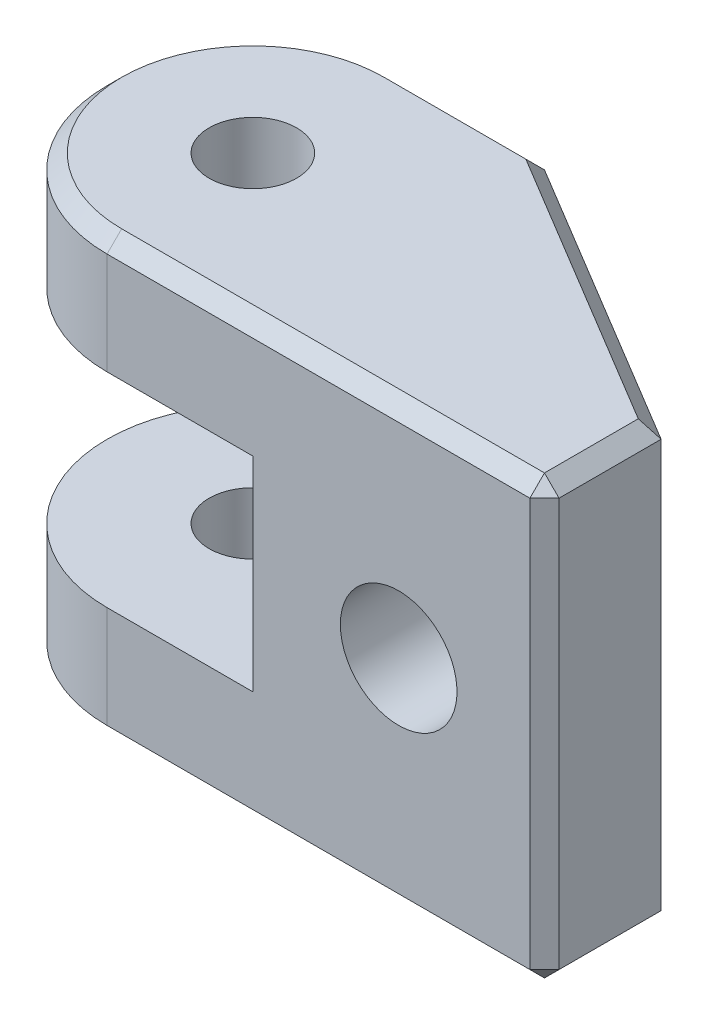
ISO-10303-21;
HEADER;
FILE_DESCRIPTION(('STEP AP214'),'2;1');
FILE_NAME('part.step','',(''),(''),'','','');
FILE_SCHEMA(('AUTOMOTIVE_DESIGN { 1 0 10303 214 1 1 1 1 }'));
ENDSEC;
DATA;
#1=APPLICATION_CONTEXT('core data for automotive mechanical design processes');
#2=APPLICATION_PROTOCOL_DEFINITION('international standard','automotive_design',2000,#1);
#3=PRODUCT_CONTEXT('',#1,'mechanical');
#4=PRODUCT('Part','Part','',(#3));
#5=PRODUCT_RELATED_PRODUCT_CATEGORY('part','',(#4));
#6=PRODUCT_DEFINITION_FORMATION('','',#4);
#7=PRODUCT_DEFINITION_CONTEXT('part definition',#1,'design');
#8=PRODUCT_DEFINITION('design','',#6,#7);
#9=PRODUCT_DEFINITION_SHAPE('','',#8);
#10=(LENGTH_UNIT() NAMED_UNIT(*) SI_UNIT(.MILLI.,.METRE.));
#11=(NAMED_UNIT(*) PLANE_ANGLE_UNIT() SI_UNIT($,.RADIAN.));
#12=(NAMED_UNIT(*) SI_UNIT($,.STERADIAN.) SOLID_ANGLE_UNIT());
#13=UNCERTAINTY_MEASURE_WITH_UNIT(LENGTH_MEASURE(1.E-05),#10,'distance_accuracy_value','');
#14=(GEOMETRIC_REPRESENTATION_CONTEXT(3) GLOBAL_UNCERTAINTY_ASSIGNED_CONTEXT((#13)) GLOBAL_UNIT_ASSIGNED_CONTEXT((#10,
#11,#12)) REPRESENTATION_CONTEXT('',''));
#15=CARTESIAN_POINT('',(0.,0.,0.));
#16=DIRECTION('',(0.,0.,1.));
#17=DIRECTION('',(1.,0.,0.));
#18=AXIS2_PLACEMENT_3D('',#15,#16,#17);
#19=CARTESIAN_POINT('',(10.,15.,-10.));
#20=DIRECTION('',(-0.514495755427526,0.,0.857492925712544));
#21=DIRECTION('',(0.857492925712544,0.,0.514495755427526));
#22=AXIS2_PLACEMENT_3D('',#19,#20,#21);
#23=PLANE('',#22);
#24=DIRECTION('',(0.,-1.,0.));
#25=VECTOR('',#24,1.);
#26=CARTESIAN_POINT('',(20.,15.,-4.));
#27=LINE('',#26,#25);
#28=CARTESIAN_POINT('',(20.,4.,-4.));
#29=VERTEX_POINT('',#28);
#30=CARTESIAN_POINT('',(20.,0.500000000000002,-4.));
#31=VERTEX_POINT('',#30);
#32=EDGE_CURVE('E182',#29,#31,#27,.T.);
#33=ORIENTED_EDGE('',*,*,#32,.T.);
#34=DIRECTION('',(-0.857492925712544,0.,-0.514495755427526));
#35=VECTOR('',#34,1.);
#36=CARTESIAN_POINT('',(10.,0.500000000000002,-10.));
#37=LINE('',#36,#35);
#38=CARTESIAN_POINT('',(10.,0.500000000000002,-10.));
#39=VERTEX_POINT('',#38);
#40=EDGE_CURVE('E281',#31,#39,#37,.T.);
#41=ORIENTED_EDGE('',*,*,#40,.T.);
#42=DIRECTION('',(0.,-1.,0.));
#43=VECTOR('',#42,1.);
#44=CARTESIAN_POINT('',(10.,15.,-10.));
#45=LINE('',#44,#43);
#46=CARTESIAN_POINT('',(10.,4.,-10.));
#47=VERTEX_POINT('',#46);
#48=EDGE_CURVE('E231',#47,#39,#45,.T.);
#49=ORIENTED_EDGE('',*,*,#48,.F.);
#50=DIRECTION('',(0.857492925712544,0.,0.514495755427526));
#51=VECTOR('',#50,1.);
#52=CARTESIAN_POINT('',(10.,4.,-10.));
#53=LINE('',#52,#51);
#54=EDGE_CURVE('E193',#47,#29,#53,.T.);
#55=ORIENTED_EDGE('',*,*,#54,.T.);
#56=EDGE_LOOP('',(#33,#41,#49,#55));
#57=FACE_BOUND('',#56,.T.);
#58=ADVANCED_FACE('F33',(#57),#23,.F.);
#59=CARTESIAN_POINT('',(10.,0.,0.));
#60=DIRECTION('',(1.,0.,0.));
#61=DIRECTION('',(0.,0.,-1.));
#62=AXIS2_PLACEMENT_3D('',#59,#60,#61);
#63=PLANE('',#62);
#64=DIRECTION('',(0.,-1.,0.));
#65=VECTOR('',#64,1.);
#66=CARTESIAN_POINT('',(10.,0.,-4.));
#67=LINE('',#66,#65);
#68=CARTESIAN_POINT('',(10.,11.,-4.));
#69=VERTEX_POINT('',#68);
#70=CARTESIAN_POINT('',(10.,4.,-4.));
#71=VERTEX_POINT('',#70);
#72=EDGE_CURVE('E201',#69,#71,#67,.T.);
#73=ORIENTED_EDGE('',*,*,#72,.T.);
#74=DIRECTION('',(0.,0.,-1.));
#75=VECTOR('',#74,1.);
#76=CARTESIAN_POINT('',(10.,4.,0.));
#77=LINE('',#76,#75);
#78=CARTESIAN_POINT('',(10.,4.,0.));
#79=VERTEX_POINT('',#78);
#80=EDGE_CURVE('E228',#79,#71,#77,.T.);
#81=ORIENTED_EDGE('',*,*,#80,.F.);
#82=DIRECTION('',(0.,-1.,0.));
#83=VECTOR('',#82,1.);
#84=CARTESIAN_POINT('',(10.,0.,0.));
#85=LINE('',#84,#83);
#86=CARTESIAN_POINT('',(10.,11.,0.));
#87=VERTEX_POINT('',#86);
#88=EDGE_CURVE('E222',#87,#79,#85,.T.);
#89=ORIENTED_EDGE('',*,*,#88,.F.);
#90=DIRECTION('',(0.,0.,-1.));
#91=VECTOR('',#90,1.);
#92=CARTESIAN_POINT('',(10.,11.,0.));
#93=LINE('',#92,#91);
#94=EDGE_CURVE('E225',#87,#69,#93,.T.);
#95=ORIENTED_EDGE('',*,*,#94,.T.);
#96=EDGE_LOOP('',(#73,#81,#89,#95));
#97=FACE_BOUND('',#96,.T.);
#98=ADVANCED_FACE('F391',(#97),#63,.F.);
#99=CARTESIAN_POINT('',(0.,15.,0.));
#100=DIRECTION('',(0.,0.,-1.));
#101=DIRECTION('',(-1.,0.,0.));
#102=AXIS2_PLACEMENT_3D('',#99,#100,#101);
#103=PLANE('',#102);
#104=CARTESIAN_POINT('',(15.,7.5,0.));
#105=DIRECTION('',(0.,0.,-1.));
#106=DIRECTION('',(-1.,0.,0.));
#107=AXIS2_PLACEMENT_3D('',#104,#105,#106);
#108=CIRCLE('',#107,2.);
#109=CARTESIAN_POINT('',(13.,7.5,0.));
#110=VERTEX_POINT('',#109);
#111=EDGE_CURVE('E208',#110,#110,#108,.T.);
#112=ORIENTED_EDGE('',*,*,#111,.T.);
#113=EDGE_LOOP('',(#112));
#114=FACE_BOUND('',#113,.T.);
#115=DIRECTION('',(0.,-1.,0.));
#116=VECTOR('',#115,1.);
#117=CARTESIAN_POINT('',(5.,15.,0.));
#118=LINE('',#117,#116);
#119=CARTESIAN_POINT('',(5.,4.,0.));
#120=VERTEX_POINT('',#119);
#121=CARTESIAN_POINT('',(5.,0.500000000000002,0.));
#122=VERTEX_POINT('',#121);
#123=EDGE_CURVE('E236',#120,#122,#118,.T.);
#124=ORIENTED_EDGE('',*,*,#123,.T.);
#125=DIRECTION('',(1.,0.,0.));
#126=VECTOR('',#125,1.);
#127=CARTESIAN_POINT('',(20.,0.500000000000002,0.));
#128=LINE('',#127,#126);
#129=CARTESIAN_POINT('',(19.5,0.500000000000002,0.));
#130=VERTEX_POINT('',#129);
#131=EDGE_CURVE('E293',#122,#130,#128,.T.);
#132=ORIENTED_EDGE('',*,*,#131,.T.);
#133=DIRECTION('',(0.,1.,0.));
#134=VECTOR('',#133,1.);
#135=CARTESIAN_POINT('',(19.5,15.,0.));
#136=LINE('',#135,#134);
#137=CARTESIAN_POINT('',(19.5,14.5,0.));
#138=VERTEX_POINT('',#137);
#139=EDGE_CURVE('E291',#130,#138,#136,.T.);
#140=ORIENTED_EDGE('',*,*,#139,.T.);
#141=DIRECTION('',(-1.,0.,0.));
#142=VECTOR('',#141,1.);
#143=CARTESIAN_POINT('',(0.,14.5,0.));
#144=LINE('',#143,#142);
#145=CARTESIAN_POINT('',(5.,14.5,0.));
#146=VERTEX_POINT('',#145);
#147=EDGE_CURVE('E289',#138,#146,#144,.T.);
#148=ORIENTED_EDGE('',*,*,#147,.T.);
#149=DIRECTION('',(0.,-1.,0.));
#150=VECTOR('',#149,1.);
#151=CARTESIAN_POINT('',(5.,15.,0.));
#152=LINE('',#151,#150);
#153=CARTESIAN_POINT('',(5.,11.,0.));
#154=VERTEX_POINT('',#153);
#155=EDGE_CURVE('E181',#146,#154,#152,.T.);
#156=ORIENTED_EDGE('',*,*,#155,.T.);
#157=DIRECTION('',(-1.,0.,0.));
#158=VECTOR('',#157,1.);
#159=CARTESIAN_POINT('',(0.,11.,0.));
#160=LINE('',#159,#158);
#161=EDGE_CURVE('E220',#87,#154,#160,.T.);
#162=ORIENTED_EDGE('',*,*,#161,.F.);
#163=ORIENTED_EDGE('',*,*,#88,.T.);
#164=DIRECTION('',(1.,0.,0.));
#165=VECTOR('',#164,1.);
#166=CARTESIAN_POINT('',(0.,4.,0.));
#167=LINE('',#166,#165);
#168=EDGE_CURVE('E218',#120,#79,#167,.T.);
#169=ORIENTED_EDGE('',*,*,#168,.F.);
#170=EDGE_LOOP('',(#124,#132,#140,#148,#156,#162,#163,#169));
#171=FACE_BOUND('',#170,.T.);
#172=ADVANCED_FACE('F397',(#114,#171),#103,.F.);
#173=CARTESIAN_POINT('',(0.,15.,-10.));
#174=DIRECTION('',(0.,0.,1.));
#175=DIRECTION('',(1.,0.,0.));
#176=AXIS2_PLACEMENT_3D('',#173,#174,#175);
#177=PLANE('',#176);
#178=ORIENTED_EDGE('',*,*,#48,.T.);
#179=DIRECTION('',(-1.,0.,0.));
#180=VECTOR('',#179,1.);
#181=CARTESIAN_POINT('',(5.,0.500000000000002,-10.));
#182=LINE('',#181,#180);
#183=CARTESIAN_POINT('',(5.,0.500000000000004,-10.));
#184=VERTEX_POINT('',#183);
#185=EDGE_CURVE('E283',#39,#184,#182,.T.);
#186=ORIENTED_EDGE('',*,*,#185,.T.);
#187=DIRECTION('',(0.,-1.,0.));
#188=VECTOR('',#187,1.);
#189=CARTESIAN_POINT('',(5.,15.,-10.));
#190=LINE('',#189,#188);
#191=CARTESIAN_POINT('',(5.,4.,-10.));
#192=VERTEX_POINT('',#191);
#193=EDGE_CURVE('E243',#184,#192,#190,.F.);
#194=ORIENTED_EDGE('',*,*,#193,.T.);
#195=DIRECTION('',(1.,0.,0.));
#196=VECTOR('',#195,1.);
#197=CARTESIAN_POINT('',(0.,4.,-10.));
#198=LINE('',#197,#196);
#199=EDGE_CURVE('E217',#192,#47,#198,.T.);
#200=ORIENTED_EDGE('',*,*,#199,.T.);
#201=EDGE_LOOP('',(#178,#186,#194,#200));
#202=FACE_BOUND('',#201,.T.);
#203=ADVANCED_FACE('F414',(#202),#177,.F.);
#204=DIRECTION('',(0.,-1.,0.));
#205=VECTOR('',#204,1.);
#206=CARTESIAN_POINT('',(5.,15.,-10.));
#207=LINE('',#206,#205);
#208=CARTESIAN_POINT('',(5.,11.,-10.));
#209=VERTEX_POINT('',#208);
#210=CARTESIAN_POINT('',(5.,14.5,-10.));
#211=VERTEX_POINT('',#210);
#212=EDGE_CURVE('E250',#209,#211,#207,.F.);
#213=ORIENTED_EDGE('',*,*,#212,.T.);
#214=DIRECTION('',(1.,0.,0.));
#215=VECTOR('',#214,1.);
#216=CARTESIAN_POINT('',(0.,14.5,-10.));
#217=LINE('',#216,#215);
#218=CARTESIAN_POINT('',(10.,14.5,-10.));
#219=VERTEX_POINT('',#218);
#220=EDGE_CURVE('E42',#211,#219,#217,.T.);
#221=ORIENTED_EDGE('',*,*,#220,.T.);
#222=CARTESIAN_POINT('',(10.,11.,-10.));
#223=VERTEX_POINT('',#222);
#224=EDGE_CURVE('E233',#219,#223,#45,.T.);
#225=ORIENTED_EDGE('',*,*,#224,.T.);
#226=DIRECTION('',(-1.,0.,0.));
#227=VECTOR('',#226,1.);
#228=CARTESIAN_POINT('',(0.,11.,-10.));
#229=LINE('',#228,#227);
#230=EDGE_CURVE('E192',#223,#209,#229,.T.);
#231=ORIENTED_EDGE('',*,*,#230,.T.);
#232=EDGE_LOOP('',(#213,#221,#225,#231));
#233=FACE_BOUND('',#232,.T.);
#234=ADVANCED_FACE('F410',(#233),#177,.F.);
#235=CARTESIAN_POINT('',(20.,15.,0.));
#236=DIRECTION('',(-1.,0.,0.));
#237=DIRECTION('',(0.,0.,1.));
#238=AXIS2_PLACEMENT_3D('',#235,#236,#237);
#239=PLANE('',#238);
#240=DIRECTION('',(0.,-1.,0.));
#241=VECTOR('',#240,1.);
#242=CARTESIAN_POINT('',(20.,15.,-0.500000000000002));
#243=LINE('',#242,#241);
#244=CARTESIAN_POINT('',(20.,14.5,-0.500000000000002));
#245=VERTEX_POINT('',#244);
#246=CARTESIAN_POINT('',(20.,0.500000000000002,-0.500000000000002));
#247=VERTEX_POINT('',#246);
#248=EDGE_CURVE('E264',#245,#247,#243,.T.);
#249=ORIENTED_EDGE('',*,*,#248,.T.);
#250=DIRECTION('',(0.,0.,-1.));
#251=VECTOR('',#250,1.);
#252=CARTESIAN_POINT('',(20.,0.500000000000002,-4.));
#253=LINE('',#252,#251);
#254=EDGE_CURVE('E266',#247,#31,#253,.T.);
#255=ORIENTED_EDGE('',*,*,#254,.T.);
#256=ORIENTED_EDGE('',*,*,#32,.F.);
#257=DIRECTION('',(0.,-1.,0.));
#258=VECTOR('',#257,1.);
#259=CARTESIAN_POINT('',(20.,0.,-4.));
#260=LINE('',#259,#258);
#261=CARTESIAN_POINT('',(20.,11.,-4.));
#262=VERTEX_POINT('',#261);
#263=EDGE_CURVE('E198',#262,#29,#260,.T.);
#264=ORIENTED_EDGE('',*,*,#263,.F.);
#265=CARTESIAN_POINT('',(20.,14.5,-4.));
#266=VERTEX_POINT('',#265);
#267=EDGE_CURVE('E172',#266,#262,#27,.T.);
#268=ORIENTED_EDGE('',*,*,#267,.F.);
#269=DIRECTION('',(0.,0.,1.));
#270=VECTOR('',#269,1.);
#271=CARTESIAN_POINT('',(20.,14.5,0.));
#272=LINE('',#271,#270);
#273=EDGE_CURVE('E252',#266,#245,#272,.T.);
#274=ORIENTED_EDGE('',*,*,#273,.T.);
#275=EDGE_LOOP('',(#249,#255,#256,#264,#268,#274));
#276=FACE_BOUND('',#275,.T.);
#277=ADVANCED_FACE('F204',(#276),#239,.F.);
#278=ORIENTED_EDGE('',*,*,#224,.F.);
#279=DIRECTION('',(0.857492925712544,0.,0.514495755427526));
#280=VECTOR('',#279,1.);
#281=CARTESIAN_POINT('',(10.,14.5,-10.));
#282=LINE('',#281,#280);
#283=EDGE_CURVE('E11',#219,#266,#282,.T.);
#284=ORIENTED_EDGE('',*,*,#283,.T.);
#285=ORIENTED_EDGE('',*,*,#267,.T.);
#286=DIRECTION('',(-0.857492925712544,0.,-0.514495755427526));
#287=VECTOR('',#286,1.);
#288=CARTESIAN_POINT('',(10.,11.,-10.));
#289=LINE('',#288,#287);
#290=EDGE_CURVE('E175',#262,#223,#289,.T.);
#291=ORIENTED_EDGE('',*,*,#290,.T.);
#292=EDGE_LOOP('',(#278,#284,#285,#291));
#293=FACE_BOUND('',#292,.T.);
#294=ADVANCED_FACE('F174',(#293),#23,.F.);
#295=CARTESIAN_POINT('',(0.,15.,0.));
#296=DIRECTION('',(0.,-1.,0.));
#297=DIRECTION('',(0.,0.,-1.));
#298=AXIS2_PLACEMENT_3D('',#295,#296,#297);
#299=PLANE('',#298);
#300=DIRECTION('',(1.,0.,0.));
#301=VECTOR('',#300,1.);
#302=CARTESIAN_POINT('',(0.,15.,-0.500000000000002));
#303=LINE('',#302,#301);
#304=CARTESIAN_POINT('',(5.,15.,-0.500000000000002));
#305=VERTEX_POINT('',#304);
#306=CARTESIAN_POINT('',(19.5,15.,-0.500000000000002));
#307=VERTEX_POINT('',#306);
#308=EDGE_CURVE('E303',#305,#307,#303,.T.);
#309=ORIENTED_EDGE('',*,*,#308,.T.);
#310=DIRECTION('',(0.,0.,-1.));
#311=VECTOR('',#310,1.);
#312=CARTESIAN_POINT('',(19.5,15.,0.));
#313=LINE('',#312,#311);
#314=CARTESIAN_POINT('',(19.5,15.,-3.71690481051547));
#315=VERTEX_POINT('',#314);
#316=EDGE_CURVE('E305',#307,#315,#313,.T.);
#317=ORIENTED_EDGE('',*,*,#316,.T.);
#318=DIRECTION('',(-0.857492925712544,0.,-0.514495755427526));
#319=VECTOR('',#318,1.);
#320=CARTESIAN_POINT('',(6.801575651698,15.,-11.3359594194967));
#321=LINE('',#320,#319);
#322=CARTESIAN_POINT('',(9.86150801752578,15.,-9.5));
#323=VERTEX_POINT('',#322);
#324=EDGE_CURVE('E295',#315,#323,#321,.T.);
#325=ORIENTED_EDGE('',*,*,#324,.T.);
#326=DIRECTION('',(-1.,0.,0.));
#327=VECTOR('',#326,1.);
#328=CARTESIAN_POINT('',(0.,15.,-9.5));
#329=LINE('',#328,#327);
#330=CARTESIAN_POINT('',(5.,15.,-9.5));
#331=VERTEX_POINT('',#330);
#332=EDGE_CURVE('E297',#323,#331,#329,.T.);
#333=ORIENTED_EDGE('',*,*,#332,.T.);
#334=CARTESIAN_POINT('',(5.,15.,-5.));
#335=DIRECTION('',(0.,-1.,0.));
#336=DIRECTION('',(0.,0.,-1.));
#337=AXIS2_PLACEMENT_3D('',#334,#335,#336);
#338=CIRCLE('',#337,4.5);
#339=CARTESIAN_POINT('',(0.500000000000002,15.,-5.));
#340=VERTEX_POINT('',#339);
#341=EDGE_CURVE('E299',#331,#340,#338,.F.);
#342=ORIENTED_EDGE('',*,*,#341,.T.);
#343=CARTESIAN_POINT('',(5.,15.,-5.));
#344=DIRECTION('',(0.,-1.,0.));
#345=DIRECTION('',(0.,0.,-1.));
#346=AXIS2_PLACEMENT_3D('',#343,#344,#345);
#347=CIRCLE('',#346,4.5);
#348=EDGE_CURVE('E301',#340,#305,#347,.F.);
#349=ORIENTED_EDGE('',*,*,#348,.T.);
#350=EDGE_LOOP('',(#309,#317,#325,#333,#342,#349));
#351=FACE_BOUND('',#350,.T.);
#352=CARTESIAN_POINT('',(5.,15.,-5.));
#353=DIRECTION('',(0.,-1.,0.));
#354=DIRECTION('',(0.,0.,-1.));
#355=AXIS2_PLACEMENT_3D('',#352,#353,#354);
#356=CIRCLE('',#355,1.5);
#357=CARTESIAN_POINT('',(5.,15.,-6.5));
#358=VERTEX_POINT('',#357);
#359=EDGE_CURVE('E262',#358,#358,#356,.T.);
#360=ORIENTED_EDGE('',*,*,#359,.T.);
#361=EDGE_LOOP('',(#360));
#362=FACE_BOUND('',#361,.T.);
#363=ADVANCED_FACE('F402',(#351,#362),#299,.F.);
#364=CARTESIAN_POINT('',(0.,0.,0.));
#365=DIRECTION('',(0.,-1.,0.));
#366=DIRECTION('',(0.,0.,-1.));
#367=AXIS2_PLACEMENT_3D('',#364,#365,#366);
#368=PLANE('',#367);
#369=DIRECTION('',(0.857492925712544,0.,0.514495755427526));
#370=VECTOR('',#369,1.);
#371=CARTESIAN_POINT('',(19.7427521222862,0.,-3.57125353714372));
#372=LINE('',#371,#370);
#373=CARTESIAN_POINT('',(9.86150801752578,0.,-9.5));
#374=VERTEX_POINT('',#373);
#375=CARTESIAN_POINT('',(19.5,0.,-3.71690481051547));
#376=VERTEX_POINT('',#375);
#377=EDGE_CURVE('E276',#374,#376,#372,.T.);
#378=ORIENTED_EDGE('',*,*,#377,.T.);
#379=DIRECTION('',(0.,0.,1.));
#380=VECTOR('',#379,1.);
#381=CARTESIAN_POINT('',(19.5,0.,0.));
#382=LINE('',#381,#380);
#383=CARTESIAN_POINT('',(19.5,0.,-0.500000000000004));
#384=VERTEX_POINT('',#383);
#385=EDGE_CURVE('E278',#376,#384,#382,.T.);
#386=ORIENTED_EDGE('',*,*,#385,.T.);
#387=DIRECTION('',(-1.,0.,0.));
#388=VECTOR('',#387,1.);
#389=CARTESIAN_POINT('',(5.,0.,-0.500000000000004));
#390=LINE('',#389,#388);
#391=CARTESIAN_POINT('',(5.,0.,-0.500000000000004));
#392=VERTEX_POINT('',#391);
#393=EDGE_CURVE('E268',#384,#392,#390,.T.);
#394=ORIENTED_EDGE('',*,*,#393,.T.);
#395=CARTESIAN_POINT('',(5.,0.,-5.));
#396=DIRECTION('',(0.,-1.,0.));
#397=DIRECTION('',(0.,0.,-1.));
#398=AXIS2_PLACEMENT_3D('',#395,#396,#397);
#399=CIRCLE('',#398,4.5);
#400=CARTESIAN_POINT('',(0.500000000000002,0.,-5.));
#401=VERTEX_POINT('',#400);
#402=EDGE_CURVE('E270',#392,#401,#399,.T.);
#403=ORIENTED_EDGE('',*,*,#402,.T.);
#404=CARTESIAN_POINT('',(5.,0.,-5.));
#405=DIRECTION('',(0.,-1.,0.));
#406=DIRECTION('',(0.,0.,-1.));
#407=AXIS2_PLACEMENT_3D('',#404,#405,#406);
#408=CIRCLE('',#407,4.5);
#409=CARTESIAN_POINT('',(5.,0.,-9.5));
#410=VERTEX_POINT('',#409);
#411=EDGE_CURVE('E272',#401,#410,#408,.T.);
#412=ORIENTED_EDGE('',*,*,#411,.T.);
#413=DIRECTION('',(1.,0.,0.));
#414=VECTOR('',#413,1.);
#415=CARTESIAN_POINT('',(10.,0.,-9.5));
#416=LINE('',#415,#414);
#417=EDGE_CURVE('E274',#410,#374,#416,.T.);
#418=ORIENTED_EDGE('',*,*,#417,.T.);
#419=EDGE_LOOP('',(#378,#386,#394,#403,#412,#418));
#420=FACE_BOUND('',#419,.T.);
#421=CARTESIAN_POINT('',(5.,0.,-5.));
#422=DIRECTION('',(0.,-1.,0.));
#423=DIRECTION('',(0.,0.,-1.));
#424=AXIS2_PLACEMENT_3D('',#421,#422,#423);
#425=CIRCLE('',#424,1.5);
#426=CARTESIAN_POINT('',(5.,0.,-6.5));
#427=VERTEX_POINT('',#426);
#428=EDGE_CURVE('E357',#427,#427,#425,.T.);
#429=ORIENTED_EDGE('',*,*,#428,.F.);
#430=EDGE_LOOP('',(#429));
#431=FACE_BOUND('',#430,.T.);
#432=ADVANCED_FACE('F407',(#420,#431),#368,.T.);
#433=CARTESIAN_POINT('',(0.,4.,0.));
#434=DIRECTION('',(0.,1.,0.));
#435=DIRECTION('',(0.,0.,1.));
#436=AXIS2_PLACEMENT_3D('',#433,#434,#435);
#437=PLANE('',#436);
#438=CARTESIAN_POINT('',(5.,4.,-5.));
#439=DIRECTION('',(0.,1.,0.));
#440=DIRECTION('',(0.,0.,1.));
#441=AXIS2_PLACEMENT_3D('',#438,#439,#440);
#442=CIRCLE('',#441,1.5);
#443=CARTESIAN_POINT('',(5.,4.,-3.5));
#444=VERTEX_POINT('',#443);
#445=EDGE_CURVE('E258',#444,#444,#442,.T.);
#446=ORIENTED_EDGE('',*,*,#445,.F.);
#447=EDGE_LOOP('',(#446));
#448=FACE_BOUND('',#447,.T.);
#449=CARTESIAN_POINT('',(5.,4.,-5.));
#450=DIRECTION('',(0.,1.,0.));
#451=DIRECTION('',(0.,0.,1.));
#452=AXIS2_PLACEMENT_3D('',#449,#450,#451);
#453=CIRCLE('',#452,5.);
#454=CARTESIAN_POINT('',(0.,4.,-5.));
#455=VERTEX_POINT('',#454);
#456=EDGE_CURVE('E239',#192,#455,#453,.T.);
#457=ORIENTED_EDGE('',*,*,#456,.T.);
#458=CARTESIAN_POINT('',(5.,4.,-5.));
#459=DIRECTION('',(0.,1.,0.));
#460=DIRECTION('',(0.,0.,1.));
#461=AXIS2_PLACEMENT_3D('',#458,#459,#460);
#462=CIRCLE('',#461,5.);
#463=EDGE_CURVE('E241',#455,#120,#462,.T.);
#464=ORIENTED_EDGE('',*,*,#463,.T.);
#465=ORIENTED_EDGE('',*,*,#168,.T.);
#466=ORIENTED_EDGE('',*,*,#80,.T.);
#467=DIRECTION('',(-1.,0.,0.));
#468=VECTOR('',#467,1.);
#469=CARTESIAN_POINT('',(20.,4.,-4.));
#470=LINE('',#469,#468);
#471=EDGE_CURVE('E194',#29,#71,#470,.T.);
#472=ORIENTED_EDGE('',*,*,#471,.F.);
#473=ORIENTED_EDGE('',*,*,#54,.F.);
#474=ORIENTED_EDGE('',*,*,#199,.F.);
#475=EDGE_LOOP('',(#457,#464,#465,#466,#472,#473,#474));
#476=FACE_BOUND('',#475,.T.);
#477=ADVANCED_FACE('F386',(#448,#476),#437,.T.);
#478=CARTESIAN_POINT('',(0.,11.,0.));
#479=DIRECTION('',(0.,-1.,0.));
#480=DIRECTION('',(0.,0.,-1.));
#481=AXIS2_PLACEMENT_3D('',#478,#479,#480);
#482=PLANE('',#481);
#483=CARTESIAN_POINT('',(5.,11.,-5.));
#484=DIRECTION('',(0.,-1.,0.));
#485=DIRECTION('',(0.,0.,-1.));
#486=AXIS2_PLACEMENT_3D('',#483,#484,#485);
#487=CIRCLE('',#486,1.5);
#488=CARTESIAN_POINT('',(5.,11.,-6.5));
#489=VERTEX_POINT('',#488);
#490=EDGE_CURVE('E259',#489,#489,#487,.T.);
#491=ORIENTED_EDGE('',*,*,#490,.F.);
#492=EDGE_LOOP('',(#491));
#493=FACE_BOUND('',#492,.T.);
#494=ORIENTED_EDGE('',*,*,#161,.T.);
#495=CARTESIAN_POINT('',(5.,11.,-5.));
#496=DIRECTION('',(0.,-1.,0.));
#497=DIRECTION('',(0.,0.,-1.));
#498=AXIS2_PLACEMENT_3D('',#495,#496,#497);
#499=CIRCLE('',#498,5.);
#500=CARTESIAN_POINT('',(0.,11.,-5.));
#501=VERTEX_POINT('',#500);
#502=EDGE_CURVE('E247',#154,#501,#499,.T.);
#503=ORIENTED_EDGE('',*,*,#502,.T.);
#504=CARTESIAN_POINT('',(5.,11.,-5.));
#505=DIRECTION('',(0.,-1.,0.));
#506=DIRECTION('',(0.,0.,-1.));
#507=AXIS2_PLACEMENT_3D('',#504,#505,#506);
#508=CIRCLE('',#507,5.);
#509=EDGE_CURVE('E245',#501,#209,#508,.T.);
#510=ORIENTED_EDGE('',*,*,#509,.T.);
#511=ORIENTED_EDGE('',*,*,#230,.F.);
#512=ORIENTED_EDGE('',*,*,#290,.F.);
#513=DIRECTION('',(-1.,0.,0.));
#514=VECTOR('',#513,1.);
#515=CARTESIAN_POINT('',(20.,11.,-4.));
#516=LINE('',#515,#514);
#517=EDGE_CURVE('E189',#262,#69,#516,.T.);
#518=ORIENTED_EDGE('',*,*,#517,.T.);
#519=ORIENTED_EDGE('',*,*,#94,.F.);
#520=EDGE_LOOP('',(#494,#503,#510,#511,#512,#518,#519));
#521=FACE_BOUND('',#520,.T.);
#522=ADVANCED_FACE('F188',(#493,#521),#482,.T.);
#523=CARTESIAN_POINT('',(20.,0.,-4.));
#524=DIRECTION('',(0.,0.,-1.));
#525=DIRECTION('',(-1.,0.,0.));
#526=AXIS2_PLACEMENT_3D('',#523,#524,#525);
#527=PLANE('',#526);
#528=CARTESIAN_POINT('',(15.,7.5,-4.));
#529=DIRECTION('',(0.,0.,-1.));
#530=DIRECTION('',(-1.,0.,0.));
#531=AXIS2_PLACEMENT_3D('',#528,#529,#530);
#532=CIRCLE('',#531,2.);
#533=CARTESIAN_POINT('',(13.,7.5,-4.));
#534=VERTEX_POINT('',#533);
#535=EDGE_CURVE('E211',#534,#534,#532,.T.);
#536=ORIENTED_EDGE('',*,*,#535,.F.);
#537=EDGE_LOOP('',(#536));
#538=FACE_BOUND('',#537,.T.);
#539=ORIENTED_EDGE('',*,*,#72,.F.);
#540=ORIENTED_EDGE('',*,*,#517,.F.);
#541=ORIENTED_EDGE('',*,*,#263,.T.);
#542=ORIENTED_EDGE('',*,*,#471,.T.);
#543=EDGE_LOOP('',(#539,#540,#541,#542));
#544=FACE_BOUND('',#543,.T.);
#545=ADVANCED_FACE('F197',(#538,#544),#527,.T.);
#546=CARTESIAN_POINT('',(15.,7.5,0.));
#547=DIRECTION('',(0.,0.,-1.));
#548=DIRECTION('',(-1.,0.,0.));
#549=AXIS2_PLACEMENT_3D('',#546,#547,#548);
#550=CYLINDRICAL_SURFACE('',#549,2.);
#551=ORIENTED_EDGE('',*,*,#111,.F.);
#552=EDGE_LOOP('',(#551));
#553=FACE_BOUND('',#552,.T.);
#554=ORIENTED_EDGE('',*,*,#535,.T.);
#555=EDGE_LOOP('',(#554));
#556=FACE_BOUND('',#555,.T.);
#557=ADVANCED_FACE('F375',(#553,#556),#550,.F.);
#558=CARTESIAN_POINT('',(5.,15.,-5.));
#559=DIRECTION('',(0.,-1.,0.));
#560=DIRECTION('',(0.,0.,-1.));
#561=AXIS2_PLACEMENT_3D('',#558,#559,#560);
#562=CYLINDRICAL_SURFACE('',#561,5.);
#563=ORIENTED_EDGE('',*,*,#193,.F.);
#564=CARTESIAN_POINT('',(5.,0.500000000000004,-5.));
#565=DIRECTION('',(0.,-1.,0.));
#566=DIRECTION('',(0.,0.,-1.));
#567=AXIS2_PLACEMENT_3D('',#564,#565,#566);
#568=CIRCLE('',#567,5.);
#569=CARTESIAN_POINT('',(0.,0.500000000000004,-5.));
#570=VERTEX_POINT('',#569);
#571=EDGE_CURVE('E285',#184,#570,#568,.F.);
#572=ORIENTED_EDGE('',*,*,#571,.T.);
#573=DIRECTION('',(0.,-1.,0.));
#574=VECTOR('',#573,1.);
#575=CARTESIAN_POINT('',(0.,15.,-5.));
#576=LINE('',#575,#574);
#577=EDGE_CURVE('E253',#455,#570,#576,.T.);
#578=ORIENTED_EDGE('',*,*,#577,.F.);
#579=ORIENTED_EDGE('',*,*,#456,.F.);
#580=EDGE_LOOP('',(#563,#572,#578,#579));
#581=FACE_BOUND('',#580,.T.);
#582=ADVANCED_FACE('F383',(#581),#562,.T.);
#583=CARTESIAN_POINT('',(5.,15.,-5.));
#584=DIRECTION('',(0.,-1.,0.));
#585=DIRECTION('',(0.,0.,-1.));
#586=AXIS2_PLACEMENT_3D('',#583,#584,#585);
#587=CYLINDRICAL_SURFACE('',#586,5.);
#588=ORIENTED_EDGE('',*,*,#577,.T.);
#589=CARTESIAN_POINT('',(5.,0.500000000000004,-5.));
#590=DIRECTION('',(0.,-1.,0.));
#591=DIRECTION('',(0.,0.,-1.));
#592=AXIS2_PLACEMENT_3D('',#589,#590,#591);
#593=CIRCLE('',#592,5.);
#594=EDGE_CURVE('E287',#570,#122,#593,.F.);
#595=ORIENTED_EDGE('',*,*,#594,.T.);
#596=ORIENTED_EDGE('',*,*,#123,.F.);
#597=ORIENTED_EDGE('',*,*,#463,.F.);
#598=EDGE_LOOP('',(#588,#595,#596,#597));
#599=FACE_BOUND('',#598,.T.);
#600=ADVANCED_FACE('F418',(#599),#587,.T.);
#601=CARTESIAN_POINT('',(5.,15.,-5.));
#602=DIRECTION('',(0.,-1.,0.));
#603=DIRECTION('',(0.,0.,-1.));
#604=AXIS2_PLACEMENT_3D('',#601,#602,#603);
#605=CYLINDRICAL_SURFACE('',#604,5.);
#606=DIRECTION('',(0.,-1.,0.));
#607=VECTOR('',#606,1.);
#608=CARTESIAN_POINT('',(0.,15.,-5.));
#609=LINE('',#608,#607);
#610=CARTESIAN_POINT('',(0.,14.5,-5.));
#611=VERTEX_POINT('',#610);
#612=EDGE_CURVE('E256',#611,#501,#609,.T.);
#613=ORIENTED_EDGE('',*,*,#612,.F.);
#614=CARTESIAN_POINT('',(5.,14.5,-5.));
#615=DIRECTION('',(0.,-1.,0.));
#616=DIRECTION('',(0.,0.,-1.));
#617=AXIS2_PLACEMENT_3D('',#614,#615,#616);
#618=CIRCLE('',#617,5.);
#619=EDGE_CURVE('E57',#611,#211,#618,.T.);
#620=ORIENTED_EDGE('',*,*,#619,.T.);
#621=ORIENTED_EDGE('',*,*,#212,.F.);
#622=ORIENTED_EDGE('',*,*,#509,.F.);
#623=EDGE_LOOP('',(#613,#620,#621,#622));
#624=FACE_BOUND('',#623,.T.);
#625=ADVANCED_FACE('F421',(#624),#605,.T.);
#626=CARTESIAN_POINT('',(5.,15.,-5.));
#627=DIRECTION('',(0.,-1.,0.));
#628=DIRECTION('',(0.,0.,-1.));
#629=AXIS2_PLACEMENT_3D('',#626,#627,#628);
#630=CYLINDRICAL_SURFACE('',#629,5.);
#631=ORIENTED_EDGE('',*,*,#155,.F.);
#632=CARTESIAN_POINT('',(5.,14.5,-5.));
#633=DIRECTION('',(0.,-1.,0.));
#634=DIRECTION('',(0.,0.,-1.));
#635=AXIS2_PLACEMENT_3D('',#632,#633,#634);
#636=CIRCLE('',#635,5.);
#637=EDGE_CURVE('E308',#146,#611,#636,.T.);
#638=ORIENTED_EDGE('',*,*,#637,.T.);
#639=ORIENTED_EDGE('',*,*,#612,.T.);
#640=ORIENTED_EDGE('',*,*,#502,.F.);
#641=EDGE_LOOP('',(#631,#638,#639,#640));
#642=FACE_BOUND('',#641,.T.);
#643=ADVANCED_FACE('F426',(#642),#630,.T.);
#644=CARTESIAN_POINT('',(5.,15.,-5.));
#645=DIRECTION('',(0.,-1.,0.));
#646=DIRECTION('',(0.,0.,-1.));
#647=AXIS2_PLACEMENT_3D('',#644,#645,#646);
#648=CYLINDRICAL_SURFACE('',#647,1.5);
#649=ORIENTED_EDGE('',*,*,#490,.T.);
#650=EDGE_LOOP('',(#649));
#651=FACE_BOUND('',#650,.T.);
#652=ORIENTED_EDGE('',*,*,#359,.F.);
#653=EDGE_LOOP('',(#652));
#654=FACE_BOUND('',#653,.T.);
#655=ADVANCED_FACE('F429',(#651,#654),#648,.F.);
#656=ORIENTED_EDGE('',*,*,#445,.T.);
#657=EDGE_LOOP('',(#656));
#658=FACE_BOUND('',#657,.T.);
#659=ORIENTED_EDGE('',*,*,#428,.T.);
#660=EDGE_LOOP('',(#659));
#661=FACE_BOUND('',#660,.T.);
#662=ADVANCED_FACE('F488',(#658,#661),#648,.F.);
#663=CARTESIAN_POINT('',(5.,15.,-5.));
#664=DIRECTION('',(0.,-1.,0.));
#665=DIRECTION('',(0.,0.,-1.));
#666=AXIS2_PLACEMENT_3D('',#663,#664,#665);
#667=CONICAL_SURFACE('',#666,4.5,0.785398163397447);
#668=DIRECTION('',(-0.707106781186546,-0.707106781186549,0.));
#669=VECTOR('',#668,1.);
#670=CARTESIAN_POINT('',(0.500000000000002,15.,-5.));
#671=LINE('',#670,#669);
#672=EDGE_CURVE('E350',#340,#611,#671,.T.);
#673=ORIENTED_EDGE('',*,*,#672,.F.);
#674=ORIENTED_EDGE('',*,*,#341,.F.);
#675=DIRECTION('',(0.,0.707106781186549,0.707106781186546));
#676=VECTOR('',#675,1.);
#677=CARTESIAN_POINT('',(5.,14.5,-10.));
#678=LINE('',#677,#676);
#679=EDGE_CURVE('E37',#211,#331,#678,.T.);
#680=ORIENTED_EDGE('',*,*,#679,.F.);
#681=ORIENTED_EDGE('',*,*,#619,.F.);
#682=EDGE_LOOP('',(#673,#674,#680,#681));
#683=FACE_BOUND('',#682,.T.);
#684=ADVANCED_FACE('F35',(#683),#667,.T.);
#685=CARTESIAN_POINT('',(0.,15.,-9.5));
#686=DIRECTION('',(0.,-0.707106781186546,0.707106781186549));
#687=DIRECTION('',(-1.,0.,0.));
#688=AXIS2_PLACEMENT_3D('',#685,#686,#687);
#689=PLANE('',#688);
#690=ORIENTED_EDGE('',*,*,#679,.T.);
#691=ORIENTED_EDGE('',*,*,#332,.F.);
#692=DIRECTION('',(-0.192205425609658,0.693922572902126,0.693922572902124));
#693=VECTOR('',#692,1.);
#694=CARTESIAN_POINT('',(9.99333750607958,14.5240537170506,-9.97594628294942));
#695=LINE('',#694,#693);
#696=EDGE_CURVE('E348',#219,#323,#695,.T.);
#697=ORIENTED_EDGE('',*,*,#696,.F.);
#698=ORIENTED_EDGE('',*,*,#220,.F.);
#699=EDGE_LOOP('',(#690,#691,#697,#698));
#700=FACE_BOUND('',#699,.T.);
#701=ADVANCED_FACE('F483',(#700),#689,.F.);
#702=CARTESIAN_POINT('',(5.,15.,-5.));
#703=DIRECTION('',(0.,-1.,0.));
#704=DIRECTION('',(0.,0.,-1.));
#705=AXIS2_PLACEMENT_3D('',#702,#703,#704);
#706=CONICAL_SURFACE('',#705,4.5,0.785398163397447);
#707=ORIENTED_EDGE('',*,*,#672,.T.);
#708=ORIENTED_EDGE('',*,*,#637,.F.);
#709=DIRECTION('',(0.,-0.707106781186549,0.707106781186546));
#710=VECTOR('',#709,1.);
#711=CARTESIAN_POINT('',(5.,15.,-0.500000000000002));
#712=LINE('',#711,#710);
#713=EDGE_CURVE('E345',#305,#146,#712,.T.);
#714=ORIENTED_EDGE('',*,*,#713,.F.);
#715=ORIENTED_EDGE('',*,*,#348,.F.);
#716=EDGE_LOOP('',(#707,#708,#714,#715));
#717=FACE_BOUND('',#716,.T.);
#718=ADVANCED_FACE('F480',(#717),#706,.T.);
#719=CARTESIAN_POINT('',(6.801575651698,15.,-11.3359594194967));
#720=DIRECTION('',(-0.363803437554499,-0.707106781186549,0.606339062590831));
#721=DIRECTION('',(-0.857492925712544,0.,-0.514495755427526));
#722=AXIS2_PLACEMENT_3D('',#719,#720,#721);
#723=PLANE('',#722);
#724=ORIENTED_EDGE('',*,*,#696,.T.);
#725=ORIENTED_EDGE('',*,*,#324,.F.);
#726=DIRECTION('',(0.656451309015364,-0.656451309015364,-0.371676415426147));
#727=VECTOR('',#726,1.);
#728=CARTESIAN_POINT('',(15.8868431684143,18.6131568315857,-1.6711701747653));
#729=LINE('',#728,#727);
#730=EDGE_CURVE('E343',#266,#315,#729,.F.);
#731=ORIENTED_EDGE('',*,*,#730,.F.);
#732=ORIENTED_EDGE('',*,*,#283,.F.);
#733=EDGE_LOOP('',(#724,#725,#731,#732));
#734=FACE_BOUND('',#733,.T.);
#735=ADVANCED_FACE('F476',(#734),#723,.F.);
#736=CARTESIAN_POINT('',(0.,15.,-0.500000000000002));
#737=DIRECTION('',(0.,-0.707106781186546,-0.707106781186549));
#738=DIRECTION('',(1.,0.,0.));
#739=AXIS2_PLACEMENT_3D('',#736,#737,#738);
#740=PLANE('',#739);
#741=ORIENTED_EDGE('',*,*,#713,.T.);
#742=ORIENTED_EDGE('',*,*,#147,.F.);
#743=DIRECTION('',(0.,0.707106781186549,-0.707106781186546));
#744=VECTOR('',#743,1.);
#745=CARTESIAN_POINT('',(19.5,14.5,0.));
#746=LINE('',#745,#744);
#747=EDGE_CURVE('E340',#307,#138,#746,.F.);
#748=ORIENTED_EDGE('',*,*,#747,.F.);
#749=ORIENTED_EDGE('',*,*,#308,.F.);
#750=EDGE_LOOP('',(#741,#742,#748,#749));
#751=FACE_BOUND('',#750,.T.);
#752=ADVANCED_FACE('F472',(#751),#740,.F.);
#753=CARTESIAN_POINT('',(19.5,15.,0.));
#754=DIRECTION('',(-0.707106781186547,-0.707106781186547,0.));
#755=DIRECTION('',(0.,0.,-1.));
#756=AXIS2_PLACEMENT_3D('',#753,#754,#755);
#757=PLANE('',#756);
#758=ORIENTED_EDGE('',*,*,#730,.T.);
#759=ORIENTED_EDGE('',*,*,#316,.F.);
#760=DIRECTION('',(0.707106781186548,-0.707106781186548,0.));
#761=VECTOR('',#760,1.);
#762=CARTESIAN_POINT('',(19.75,14.75,-0.500000000000002));
#763=LINE('',#762,#761);
#764=EDGE_CURVE('E337',#245,#307,#763,.F.);
#765=ORIENTED_EDGE('',*,*,#764,.F.);
#766=ORIENTED_EDGE('',*,*,#273,.F.);
#767=EDGE_LOOP('',(#758,#759,#765,#766));
#768=FACE_BOUND('',#767,.T.);
#769=ADVANCED_FACE('F468',(#768),#757,.F.);
#770=CARTESIAN_POINT('',(5.,0.,-5.));
#771=DIRECTION('',(0.,1.,0.));
#772=DIRECTION('',(0.,0.,1.));
#773=AXIS2_PLACEMENT_3D('',#770,#771,#772);
#774=CONICAL_SURFACE('',#773,4.5,0.785398163397447);
#775=DIRECTION('',(0.,-0.707106781186549,-0.707106781186546));
#776=VECTOR('',#775,1.);
#777=CARTESIAN_POINT('',(5.,0.500000000000004,0.));
#778=LINE('',#777,#776);
#779=EDGE_CURVE('E331',#122,#392,#778,.T.);
#780=ORIENTED_EDGE('',*,*,#779,.F.);
#781=ORIENTED_EDGE('',*,*,#594,.F.);
#782=DIRECTION('',(-0.707106781186546,0.707106781186549,0.));
#783=VECTOR('',#782,1.);
#784=CARTESIAN_POINT('',(0.500000000000002,0.,-5.));
#785=LINE('',#784,#783);
#786=EDGE_CURVE('E334',#401,#570,#785,.T.);
#787=ORIENTED_EDGE('',*,*,#786,.F.);
#788=ORIENTED_EDGE('',*,*,#402,.F.);
#789=EDGE_LOOP('',(#780,#781,#787,#788));
#790=FACE_BOUND('',#789,.T.);
#791=ADVANCED_FACE('F464',(#790),#774,.T.);
#792=CARTESIAN_POINT('',(19.5,14.5,0.));
#793=DIRECTION('',(0.577350269189625,0.577350269189625,0.577350269189627));
#794=DIRECTION('',(0.707106781186549,0.,-0.707106781186546));
#795=AXIS2_PLACEMENT_3D('',#792,#793,#794);
#796=PLANE('',#795);
#797=ORIENTED_EDGE('',*,*,#764,.T.);
#798=ORIENTED_EDGE('',*,*,#747,.T.);
#799=DIRECTION('',(-0.707106781186549,0.,0.707106781186546));
#800=VECTOR('',#799,1.);
#801=CARTESIAN_POINT('',(19.5,14.5,0.));
#802=LINE('',#801,#800);
#803=EDGE_CURVE('E328',#245,#138,#802,.T.);
#804=ORIENTED_EDGE('',*,*,#803,.F.);
#805=EDGE_LOOP('',(#797,#798,#804));
#806=FACE_BOUND('',#805,.T.);
#807=ADVANCED_FACE('F460',(#806),#796,.T.);
#808=CARTESIAN_POINT('',(5.,0.,-5.));
#809=DIRECTION('',(0.,1.,0.));
#810=DIRECTION('',(0.,0.,1.));
#811=AXIS2_PLACEMENT_3D('',#808,#809,#810);
#812=CONICAL_SURFACE('',#811,4.5,0.785398163397447);
#813=ORIENTED_EDGE('',*,*,#786,.T.);
#814=ORIENTED_EDGE('',*,*,#571,.F.);
#815=DIRECTION('',(0.,0.707106781186549,-0.707106781186546));
#816=VECTOR('',#815,1.);
#817=CARTESIAN_POINT('',(5.,0.,-9.5));
#818=LINE('',#817,#816);
#819=EDGE_CURVE('E325',#410,#184,#818,.T.);
#820=ORIENTED_EDGE('',*,*,#819,.F.);
#821=ORIENTED_EDGE('',*,*,#411,.F.);
#822=EDGE_LOOP('',(#813,#814,#820,#821));
#823=FACE_BOUND('',#822,.T.);
#824=ADVANCED_FACE('F456',(#823),#812,.T.);
#825=CARTESIAN_POINT('',(0.,0.500000000000002,0.));
#826=DIRECTION('',(0.,-0.707106781186549,0.707106781186546));
#827=DIRECTION('',(-1.,0.,0.));
#828=AXIS2_PLACEMENT_3D('',#825,#826,#827);
#829=PLANE('',#828);
#830=ORIENTED_EDGE('',*,*,#779,.T.);
#831=ORIENTED_EDGE('',*,*,#393,.F.);
#832=DIRECTION('',(0.,-0.707106781186546,-0.707106781186549));
#833=VECTOR('',#832,1.);
#834=CARTESIAN_POINT('',(19.5,0.,-0.500000000000004));
#835=LINE('',#834,#833);
#836=EDGE_CURVE('E322',#130,#384,#835,.T.);
#837=ORIENTED_EDGE('',*,*,#836,.F.);
#838=ORIENTED_EDGE('',*,*,#131,.F.);
#839=EDGE_LOOP('',(#830,#831,#837,#838));
#840=FACE_BOUND('',#839,.T.);
#841=ADVANCED_FACE('F452',(#840),#829,.T.);
#842=CARTESIAN_POINT('',(20.,15.,-0.500000000000002));
#843=DIRECTION('',(-0.707106781186546,0.,-0.707106781186549));
#844=DIRECTION('',(0.,-1.,0.));
#845=AXIS2_PLACEMENT_3D('',#842,#843,#844);
#846=PLANE('',#845);
#847=ORIENTED_EDGE('',*,*,#803,.T.);
#848=ORIENTED_EDGE('',*,*,#139,.F.);
#849=DIRECTION('',(0.707106781186549,0.,-0.707106781186546));
#850=VECTOR('',#849,1.);
#851=CARTESIAN_POINT('',(19.75,0.500000000000002,-0.250000000000001));
#852=LINE('',#851,#850);
#853=EDGE_CURVE('E319',#247,#130,#852,.F.);
#854=ORIENTED_EDGE('',*,*,#853,.F.);
#855=ORIENTED_EDGE('',*,*,#248,.F.);
#856=EDGE_LOOP('',(#847,#848,#854,#855));
#857=FACE_BOUND('',#856,.T.);
#858=ADVANCED_FACE('F448',(#857),#846,.F.);
#859=CARTESIAN_POINT('',(0.,0.500000000000002,-10.));
#860=DIRECTION('',(0.,-0.707106781186549,-0.707106781186546));
#861=DIRECTION('',(1.,0.,0.));
#862=AXIS2_PLACEMENT_3D('',#859,#860,#861);
#863=PLANE('',#862);
#864=ORIENTED_EDGE('',*,*,#819,.T.);
#865=ORIENTED_EDGE('',*,*,#185,.F.);
#866=DIRECTION('',(-0.192205425609655,-0.693922572902124,0.693922572902127));
#867=VECTOR('',#866,1.);
#868=CARTESIAN_POINT('',(9.63057074366212,-0.833756834647992,-8.666243165352));
#869=LINE('',#868,#867);
#870=EDGE_CURVE('E316',#374,#39,#869,.F.);
#871=ORIENTED_EDGE('',*,*,#870,.F.);
#872=ORIENTED_EDGE('',*,*,#417,.F.);
#873=EDGE_LOOP('',(#864,#865,#871,#872));
#874=FACE_BOUND('',#873,.T.);
#875=ADVANCED_FACE('F444',(#874),#863,.T.);
#876=CARTESIAN_POINT('',(19.5,0.,-0.500000000000004));
#877=DIRECTION('',(0.577350269189624,-0.577350269189628,0.577350269189626));
#878=DIRECTION('',(0.,-0.707106781186546,-0.707106781186549));
#879=AXIS2_PLACEMENT_3D('',#876,#877,#878);
#880=PLANE('',#879);
#881=ORIENTED_EDGE('',*,*,#853,.T.);
#882=ORIENTED_EDGE('',*,*,#836,.T.);
#883=DIRECTION('',(0.707106781186549,0.707106781186546,0.));
#884=VECTOR('',#883,1.);
#885=CARTESIAN_POINT('',(19.5,0.,-0.500000000000004));
#886=LINE('',#885,#884);
#887=EDGE_CURVE('E314',#247,#384,#886,.F.);
#888=ORIENTED_EDGE('',*,*,#887,.F.);
#889=EDGE_LOOP('',(#881,#882,#888));
#890=FACE_BOUND('',#889,.T.);
#891=ADVANCED_FACE('F440',(#890),#880,.T.);
#892=CARTESIAN_POINT('',(10.,0.500000000000002,-10.));
#893=DIRECTION('',(0.363803437554498,-0.70710678118655,-0.60633906259083));
#894=DIRECTION('',(0.857492925712544,0.,0.514495755427526));
#895=AXIS2_PLACEMENT_3D('',#892,#893,#894);
#896=PLANE('',#895);
#897=ORIENTED_EDGE('',*,*,#870,.T.);
#898=ORIENTED_EDGE('',*,*,#40,.F.);
#899=DIRECTION('',(-0.656451309015365,-0.656451309015363,0.371676415426148));
#900=VECTOR('',#899,1.);
#901=CARTESIAN_POINT('',(17.1546416055399,-2.34535839446005,-2.38898545233785));
#902=LINE('',#901,#900);
#903=EDGE_CURVE('E312',#376,#31,#902,.F.);
#904=ORIENTED_EDGE('',*,*,#903,.F.);
#905=ORIENTED_EDGE('',*,*,#377,.F.);
#906=EDGE_LOOP('',(#897,#898,#904,#905));
#907=FACE_BOUND('',#906,.T.);
#908=ADVANCED_FACE('F436',(#907),#896,.T.);
#909=CARTESIAN_POINT('',(20.,0.500000000000002,0.));
#910=DIRECTION('',(0.707106781186546,-0.707106781186549,0.));
#911=DIRECTION('',(0.,0.,1.));
#912=AXIS2_PLACEMENT_3D('',#909,#910,#911);
#913=PLANE('',#912);
#914=ORIENTED_EDGE('',*,*,#887,.T.);
#915=ORIENTED_EDGE('',*,*,#385,.F.);
#916=ORIENTED_EDGE('',*,*,#903,.T.);
#917=ORIENTED_EDGE('',*,*,#254,.F.);
#918=EDGE_LOOP('',(#914,#915,#916,#917));
#919=FACE_BOUND('',#918,.T.);
#920=ADVANCED_FACE('F433',(#919),#913,.T.);
#921=CLOSED_SHELL('',(#58,#98,#172,#203,#234,#277,#294,#363,#432,#477,#522,#545,#557,#582,#600,
#625,#643,#655,#662,#684,#701,#718,#735,#752,#769,#791,#807,#824,#841,#858,#875,#891,#908,#920));
#922=MANIFOLD_SOLID_BREP('B2',#921);
#923=ADVANCED_BREP_SHAPE_REPRESENTATION('',(#18,#922),#14);
#924=SHAPE_DEFINITION_REPRESENTATION(#9,#923);
ENDSEC;
END-ISO-10303-21;
